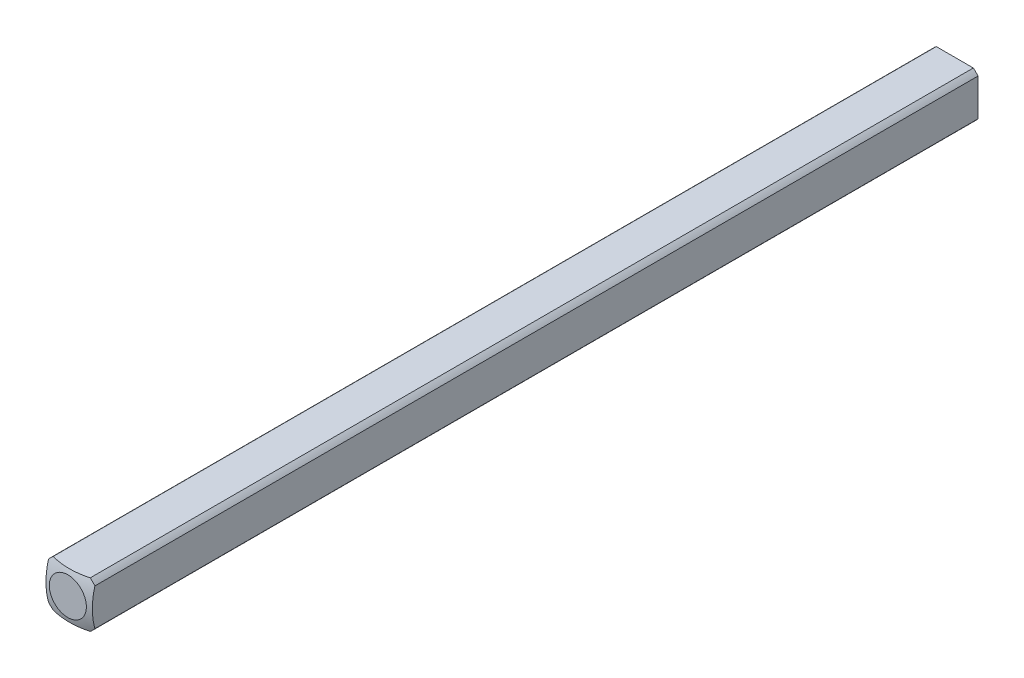
ISO-10303-21;
HEADER;
FILE_DESCRIPTION(('STEP AP214'),'2;1');
FILE_NAME('part.step','',(''),(''),'','','');
FILE_SCHEMA(('AUTOMOTIVE_DESIGN { 1 0 10303 214 1 1 1 1 }'));
ENDSEC;
DATA;
#1=APPLICATION_CONTEXT('core data for automotive mechanical design processes');
#2=APPLICATION_PROTOCOL_DEFINITION('international standard','automotive_design',2000,#1);
#3=PRODUCT_CONTEXT('',#1,'mechanical');
#4=PRODUCT('Part','Part','',(#3));
#5=PRODUCT_RELATED_PRODUCT_CATEGORY('part','',(#4));
#6=PRODUCT_DEFINITION_FORMATION('','',#4);
#7=PRODUCT_DEFINITION_CONTEXT('part definition',#1,'design');
#8=PRODUCT_DEFINITION('design','',#6,#7);
#9=PRODUCT_DEFINITION_SHAPE('','',#8);
#10=(LENGTH_UNIT() NAMED_UNIT(*) SI_UNIT(.MILLI.,.METRE.));
#11=(NAMED_UNIT(*) PLANE_ANGLE_UNIT() SI_UNIT($,.RADIAN.));
#12=(NAMED_UNIT(*) SI_UNIT($,.STERADIAN.) SOLID_ANGLE_UNIT());
#13=UNCERTAINTY_MEASURE_WITH_UNIT(LENGTH_MEASURE(1.E-05),#10,'distance_accuracy_value','');
#14=(GEOMETRIC_REPRESENTATION_CONTEXT(3) GLOBAL_UNCERTAINTY_ASSIGNED_CONTEXT((#13)) GLOBAL_UNIT_ASSIGNED_CONTEXT((#10,
#11,#12)) REPRESENTATION_CONTEXT('',''));
#15=CARTESIAN_POINT('',(0.,0.,0.));
#16=DIRECTION('',(0.,0.,1.));
#17=DIRECTION('',(1.,0.,0.));
#18=AXIS2_PLACEMENT_3D('',#15,#16,#17);
#19=CARTESIAN_POINT('',(-1.5875,-1.5875,152.4));
#20=DIRECTION('',(1.,0.,0.));
#21=DIRECTION('',(0.,0.,-1.));
#22=AXIS2_PLACEMENT_3D('',#19,#20,#21);
#23=PLANE('',#22);
#24=DIRECTION('',(0.,0.,-1.));
#25=VECTOR('',#24,1.);
#26=CARTESIAN_POINT('',(-1.5875,1.26841150657032,152.4));
#27=LINE('',#26,#25);
#28=CARTESIAN_POINT('',(-1.5875,1.26841150657032,244.103225357687));
#29=VERTEX_POINT('',#28);
#30=CARTESIAN_POINT('',(-1.5875,1.26841150657032,304.536774642313));
#31=VERTEX_POINT('',#30);
#32=EDGE_CURVE('E54',#29,#31,#27,.F.);
#33=ORIENTED_EDGE('',*,*,#32,.F.);
#34=DIRECTION('',(0.,-1.,0.));
#35=VECTOR('',#34,1.);
#36=CARTESIAN_POINT('',(-1.5875,1.5875,244.103225357687));
#37=LINE('',#36,#35);
#38=CARTESIAN_POINT('',(-1.5875,-1.26841150657032,244.103225357687));
#39=VERTEX_POINT('',#38);
#40=EDGE_CURVE('E47',#29,#39,#37,.T.);
#41=ORIENTED_EDGE('',*,*,#40,.T.);
#42=DIRECTION('',(0.,0.,-1.));
#43=VECTOR('',#42,1.);
#44=CARTESIAN_POINT('',(-1.5875,-1.26841150657032,152.4));
#45=LINE('',#44,#43);
#46=CARTESIAN_POINT('',(-1.5875,-1.26841150657032,304.536774642313));
#47=VERTEX_POINT('',#46);
#48=EDGE_CURVE('E41',#47,#39,#45,.T.);
#49=ORIENTED_EDGE('',*,*,#48,.F.);
#50=CARTESIAN_POINT('',(-1.5875,0.,299.880877736238));
#51=DIRECTION('',(-1.,0.,0.));
#52=DIRECTION('',(0.,0.,1.));
#53=AXIS2_PLACEMENT_3D('',#50,#51,#52);
#54=CIRCLE('',#53,4.82558221875869);
#55=EDGE_CURVE('E136',#47,#31,#54,.T.);
#56=ORIENTED_EDGE('',*,*,#55,.T.);
#57=EDGE_LOOP('',(#33,#41,#49,#56));
#58=FACE_BOUND('',#57,.T.);
#59=ADVANCED_FACE('F34',(#58),#23,.F.);
#60=CARTESIAN_POINT('',(-1.5875,-1.5875,152.4));
#61=DIRECTION('',(0.,1.,0.));
#62=DIRECTION('',(0.,0.,1.));
#63=AXIS2_PLACEMENT_3D('',#60,#61,#62);
#64=PLANE('',#63);
#65=DIRECTION('',(0.,0.,-1.));
#66=VECTOR('',#65,1.);
#67=CARTESIAN_POINT('',(-1.26841150657032,-1.5875,152.4));
#68=LINE('',#67,#66);
#69=CARTESIAN_POINT('',(-1.26841150657032,-1.5875,244.103225357687));
#70=VERTEX_POINT('',#69);
#71=CARTESIAN_POINT('',(-1.26841150657032,-1.5875,304.536774642313));
#72=VERTEX_POINT('',#71);
#73=EDGE_CURVE('E115',#70,#72,#68,.F.);
#74=ORIENTED_EDGE('',*,*,#73,.F.);
#75=DIRECTION('',(-1.,0.,0.));
#76=VECTOR('',#75,1.);
#77=CARTESIAN_POINT('',(1.58749999999999,-1.5875,244.103225357687));
#78=LINE('',#77,#76);
#79=CARTESIAN_POINT('',(1.26841150657032,-1.5875,244.103225357687));
#80=VERTEX_POINT('',#79);
#81=EDGE_CURVE('E99',#80,#70,#78,.T.);
#82=ORIENTED_EDGE('',*,*,#81,.F.);
#83=DIRECTION('',(0.,0.,-1.));
#84=VECTOR('',#83,1.);
#85=CARTESIAN_POINT('',(1.26841150657032,-1.5875,152.4));
#86=LINE('',#85,#84);
#87=CARTESIAN_POINT('',(1.26841150657032,-1.5875,304.536774642313));
#88=VERTEX_POINT('',#87);
#89=EDGE_CURVE('E113',#88,#80,#86,.T.);
#90=ORIENTED_EDGE('',*,*,#89,.F.);
#91=CARTESIAN_POINT('',(0.,-1.5875,299.880877736238));
#92=DIRECTION('',(0.,-1.,0.));
#93=DIRECTION('',(0.,0.,-1.));
#94=AXIS2_PLACEMENT_3D('',#91,#92,#93);
#95=CIRCLE('',#94,4.82558221875869);
#96=EDGE_CURVE('E154',#88,#72,#95,.T.);
#97=ORIENTED_EDGE('',*,*,#96,.T.);
#98=EDGE_LOOP('',(#74,#82,#90,#97));
#99=FACE_BOUND('',#98,.T.);
#100=ADVANCED_FACE('F111',(#99),#64,.F.);
#101=CARTESIAN_POINT('',(1.5875,-1.5875,152.4));
#102=DIRECTION('',(-1.,0.,0.));
#103=DIRECTION('',(0.,0.,1.));
#104=AXIS2_PLACEMENT_3D('',#101,#102,#103);
#105=PLANE('',#104);
#106=DIRECTION('',(0.,0.,-1.));
#107=VECTOR('',#106,1.);
#108=CARTESIAN_POINT('',(1.5875,-1.26841150657032,152.4));
#109=LINE('',#108,#107);
#110=CARTESIAN_POINT('',(1.58749999999999,-1.26841150657033,244.103225357687));
#111=VERTEX_POINT('',#110);
#112=CARTESIAN_POINT('',(1.5875,-1.26841150657032,304.536774642313));
#113=VERTEX_POINT('',#112);
#114=EDGE_CURVE('E167',#111,#113,#109,.F.);
#115=ORIENTED_EDGE('',*,*,#114,.F.);
#116=DIRECTION('',(0.,-1.,0.));
#117=VECTOR('',#116,1.);
#118=CARTESIAN_POINT('',(1.58749999999999,1.5875,244.103225357687));
#119=LINE('',#118,#117);
#120=CARTESIAN_POINT('',(1.58749999999999,1.26841150657033,244.103225357687));
#121=VERTEX_POINT('',#120);
#122=EDGE_CURVE('E102',#121,#111,#119,.T.);
#123=ORIENTED_EDGE('',*,*,#122,.F.);
#124=DIRECTION('',(0.,0.,-1.));
#125=VECTOR('',#124,1.);
#126=CARTESIAN_POINT('',(1.5875,1.26841150657032,152.4));
#127=LINE('',#126,#125);
#128=CARTESIAN_POINT('',(1.5875,1.26841150657032,304.536774642313));
#129=VERTEX_POINT('',#128);
#130=EDGE_CURVE('E124',#129,#121,#127,.T.);
#131=ORIENTED_EDGE('',*,*,#130,.F.);
#132=CARTESIAN_POINT('',(1.5875,0.,299.880877736238));
#133=DIRECTION('',(1.,0.,0.));
#134=DIRECTION('',(0.,0.,-1.));
#135=AXIS2_PLACEMENT_3D('',#132,#133,#134);
#136=CIRCLE('',#135,4.82558221875869);
#137=EDGE_CURVE('E151',#129,#113,#136,.T.);
#138=ORIENTED_EDGE('',*,*,#137,.T.);
#139=EDGE_LOOP('',(#115,#123,#131,#138));
#140=FACE_BOUND('',#139,.T.);
#141=ADVANCED_FACE('F176',(#140),#105,.F.);
#142=CARTESIAN_POINT('',(-1.5875,1.5875,152.4));
#143=DIRECTION('',(0.,-1.,0.));
#144=DIRECTION('',(0.,0.,-1.));
#145=AXIS2_PLACEMENT_3D('',#142,#143,#144);
#146=PLANE('',#145);
#147=DIRECTION('',(0.,0.,-1.));
#148=VECTOR('',#147,1.);
#149=CARTESIAN_POINT('',(1.26841150657032,1.5875,152.4));
#150=LINE('',#149,#148);
#151=CARTESIAN_POINT('',(1.26841150657032,1.5875,244.103225357687));
#152=VERTEX_POINT('',#151);
#153=CARTESIAN_POINT('',(1.26841150657032,1.5875,304.536774642313));
#154=VERTEX_POINT('',#153);
#155=EDGE_CURVE('E162',#152,#154,#150,.F.);
#156=ORIENTED_EDGE('',*,*,#155,.F.);
#157=DIRECTION('',(-1.,0.,0.));
#158=VECTOR('',#157,1.);
#159=CARTESIAN_POINT('',(1.58749999999999,1.5875,244.103225357687));
#160=LINE('',#159,#158);
#161=CARTESIAN_POINT('',(-1.26841150657032,1.5875,244.103225357687));
#162=VERTEX_POINT('',#161);
#163=EDGE_CURVE('E116',#152,#162,#160,.T.);
#164=ORIENTED_EDGE('',*,*,#163,.T.);
#165=DIRECTION('',(0.,0.,-1.));
#166=VECTOR('',#165,1.);
#167=CARTESIAN_POINT('',(-1.26841150657032,1.5875,152.4));
#168=LINE('',#167,#166);
#169=CARTESIAN_POINT('',(-1.26841150657032,1.5875,304.536774642313));
#170=VERTEX_POINT('',#169);
#171=EDGE_CURVE('E164',#170,#162,#168,.T.);
#172=ORIENTED_EDGE('',*,*,#171,.F.);
#173=CARTESIAN_POINT('',(0.,1.5875,299.880877736238));
#174=DIRECTION('',(0.,1.,0.));
#175=DIRECTION('',(0.,0.,1.));
#176=AXIS2_PLACEMENT_3D('',#173,#174,#175);
#177=CIRCLE('',#176,4.82558221875869);
#178=EDGE_CURVE('E143',#170,#154,#177,.T.);
#179=ORIENTED_EDGE('',*,*,#178,.T.);
#180=EDGE_LOOP('',(#156,#164,#172,#179));
#181=FACE_BOUND('',#180,.T.);
#182=ADVANCED_FACE('F183',(#181),#146,.F.);
#183=CARTESIAN_POINT('',(0.,0.,152.4));
#184=DIRECTION('',(0.,0.,-1.));
#185=DIRECTION('',(-1.,0.,0.));
#186=AXIS2_PLACEMENT_3D('',#183,#184,#185);
#187=CYLINDRICAL_SURFACE('',#186,2.032);
#188=CARTESIAN_POINT('',(0.,0.,244.103225357687));
#189=DIRECTION('',(0.,0.,1.));
#190=DIRECTION('',(1.,0.,0.));
#191=AXIS2_PLACEMENT_3D('',#188,#189,#190);
#192=CIRCLE('',#191,2.032);
#193=EDGE_CURVE('E106',#70,#39,#192,.F.);
#194=ORIENTED_EDGE('',*,*,#193,.F.);
#195=ORIENTED_EDGE('',*,*,#73,.T.);
#196=CARTESIAN_POINT('',(0.,0.,304.536774642313));
#197=DIRECTION('',(0.,0.,1.));
#198=DIRECTION('',(1.,0.,0.));
#199=AXIS2_PLACEMENT_3D('',#196,#197,#198);
#200=CIRCLE('',#199,2.032);
#201=EDGE_CURVE('E132',#47,#72,#200,.T.);
#202=ORIENTED_EDGE('',*,*,#201,.F.);
#203=ORIENTED_EDGE('',*,*,#48,.T.);
#204=EDGE_LOOP('',(#194,#195,#202,#203));
#205=FACE_BOUND('',#204,.T.);
#206=ADVANCED_FACE('F130',(#205),#187,.T.);
#207=CARTESIAN_POINT('',(0.,0.,244.103225357687));
#208=DIRECTION('',(0.,0.,1.));
#209=DIRECTION('',(1.,0.,0.));
#210=AXIS2_PLACEMENT_3D('',#207,#208,#209);
#211=CIRCLE('',#210,2.032);
#212=EDGE_CURVE('E96',#111,#80,#211,.F.);
#213=ORIENTED_EDGE('',*,*,#212,.F.);
#214=ORIENTED_EDGE('',*,*,#114,.T.);
#215=CARTESIAN_POINT('',(0.,0.,304.536774642313));
#216=DIRECTION('',(0.,0.,1.));
#217=DIRECTION('',(1.,0.,0.));
#218=AXIS2_PLACEMENT_3D('',#215,#216,#217);
#219=CIRCLE('',#218,2.032);
#220=EDGE_CURVE('E120',#88,#113,#219,.T.);
#221=ORIENTED_EDGE('',*,*,#220,.F.);
#222=ORIENTED_EDGE('',*,*,#89,.T.);
#223=EDGE_LOOP('',(#213,#214,#221,#222));
#224=FACE_BOUND('',#223,.T.);
#225=ADVANCED_FACE('F118',(#224),#187,.T.);
#226=CARTESIAN_POINT('',(0.,0.,244.103225357687));
#227=DIRECTION('',(0.,0.,1.));
#228=DIRECTION('',(1.,0.,0.));
#229=AXIS2_PLACEMENT_3D('',#226,#227,#228);
#230=CIRCLE('',#229,2.032);
#231=EDGE_CURVE('E107',#152,#121,#230,.F.);
#232=ORIENTED_EDGE('',*,*,#231,.F.);
#233=ORIENTED_EDGE('',*,*,#155,.T.);
#234=CARTESIAN_POINT('',(0.,0.,304.536774642313));
#235=DIRECTION('',(0.,0.,1.));
#236=DIRECTION('',(1.,0.,0.));
#237=AXIS2_PLACEMENT_3D('',#234,#235,#236);
#238=CIRCLE('',#237,2.032);
#239=EDGE_CURVE('E147',#129,#154,#238,.T.);
#240=ORIENTED_EDGE('',*,*,#239,.F.);
#241=ORIENTED_EDGE('',*,*,#130,.T.);
#242=EDGE_LOOP('',(#232,#233,#240,#241));
#243=FACE_BOUND('',#242,.T.);
#244=ADVANCED_FACE('F172',(#243),#187,.T.);
#245=CARTESIAN_POINT('',(0.,0.,244.103225357687));
#246=DIRECTION('',(0.,0.,1.));
#247=DIRECTION('',(1.,0.,0.));
#248=AXIS2_PLACEMENT_3D('',#245,#246,#247);
#249=CIRCLE('',#248,2.032);
#250=EDGE_CURVE('E12',#29,#162,#249,.F.);
#251=ORIENTED_EDGE('',*,*,#250,.F.);
#252=ORIENTED_EDGE('',*,*,#32,.T.);
#253=CARTESIAN_POINT('',(0.,0.,304.536774642313));
#254=DIRECTION('',(0.,0.,1.));
#255=DIRECTION('',(1.,0.,0.));
#256=AXIS2_PLACEMENT_3D('',#253,#254,#255);
#257=CIRCLE('',#256,2.032);
#258=EDGE_CURVE('E160',#170,#31,#257,.T.);
#259=ORIENTED_EDGE('',*,*,#258,.F.);
#260=ORIENTED_EDGE('',*,*,#171,.T.);
#261=EDGE_LOOP('',(#251,#252,#259,#260));
#262=FACE_BOUND('',#261,.T.);
#263=ADVANCED_FACE('F180',(#262),#187,.T.);
#264=CARTESIAN_POINT('',(0.,0.,299.880877736238));
#265=DIRECTION('',(0.,0.,-1.));
#266=DIRECTION('',(-1.,0.,0.));
#267=AXIS2_PLACEMENT_3D('',#264,#265,#266);
#268=SPHERICAL_SURFACE('',#267,5.08);
#269=CARTESIAN_POINT('',(0.,0.,304.8));
#270=DIRECTION('',(0.,0.,-1.));
#271=DIRECTION('',(-1.,0.,0.));
#272=AXIS2_PLACEMENT_3D('',#269,#270,#271);
#273=CIRCLE('',#272,1.26832020963187);
#274=CARTESIAN_POINT('',(-1.26832020963187,0.,304.8));
#275=VERTEX_POINT('',#274);
#276=EDGE_CURVE('E157',#275,#275,#273,.T.);
#277=ORIENTED_EDGE('',*,*,#276,.T.);
#278=EDGE_LOOP('',(#277));
#279=FACE_BOUND('',#278,.T.);
#280=ORIENTED_EDGE('',*,*,#96,.F.);
#281=ORIENTED_EDGE('',*,*,#220,.T.);
#282=ORIENTED_EDGE('',*,*,#137,.F.);
#283=ORIENTED_EDGE('',*,*,#239,.T.);
#284=ORIENTED_EDGE('',*,*,#178,.F.);
#285=ORIENTED_EDGE('',*,*,#258,.T.);
#286=ORIENTED_EDGE('',*,*,#55,.F.);
#287=ORIENTED_EDGE('',*,*,#201,.T.);
#288=EDGE_LOOP('',(#280,#281,#282,#283,#284,#285,#286,#287));
#289=FACE_BOUND('',#288,.T.);
#290=ADVANCED_FACE('F178',(#279,#289),#268,.T.);
#291=CARTESIAN_POINT('',(0.,0.,304.8));
#292=DIRECTION('',(0.,0.,1.));
#293=DIRECTION('',(-1.,0.,0.));
#294=AXIS2_PLACEMENT_3D('',#291,#292,#293);
#295=PLANE('',#294);
#296=ORIENTED_EDGE('',*,*,#276,.F.);
#297=EDGE_LOOP('',(#296));
#298=FACE_BOUND('',#297,.T.);
#299=ADVANCED_FACE('F250',(#298),#295,.T.);
#300=CARTESIAN_POINT('',(1.58749999999999,1.5875,244.103225357687));
#301=DIRECTION('',(0.,0.,1.));
#302=DIRECTION('',(1.,0.,0.));
#303=AXIS2_PLACEMENT_3D('',#300,#301,#302);
#304=PLANE('',#303);
#305=ORIENTED_EDGE('',*,*,#193,.T.);
#306=ORIENTED_EDGE('',*,*,#40,.F.);
#307=ORIENTED_EDGE('',*,*,#250,.T.);
#308=ORIENTED_EDGE('',*,*,#163,.F.);
#309=ORIENTED_EDGE('',*,*,#231,.T.);
#310=ORIENTED_EDGE('',*,*,#122,.T.);
#311=ORIENTED_EDGE('',*,*,#212,.T.);
#312=ORIENTED_EDGE('',*,*,#81,.T.);
#313=EDGE_LOOP('',(#305,#306,#307,#308,#309,#310,#311,#312));
#314=FACE_BOUND('',#313,.T.);
#315=ADVANCED_FACE('F98',(#314),#304,.F.);
#316=CLOSED_SHELL('',(#59,#100,#141,#182,#206,#225,#244,#263,#290,#299,#315));
#317=MANIFOLD_SOLID_BREP('B2',#316);
#318=ADVANCED_BREP_SHAPE_REPRESENTATION('',(#18,#317),#14);
#319=SHAPE_DEFINITION_REPRESENTATION(#9,#318);
ENDSEC;
END-ISO-10303-21;
